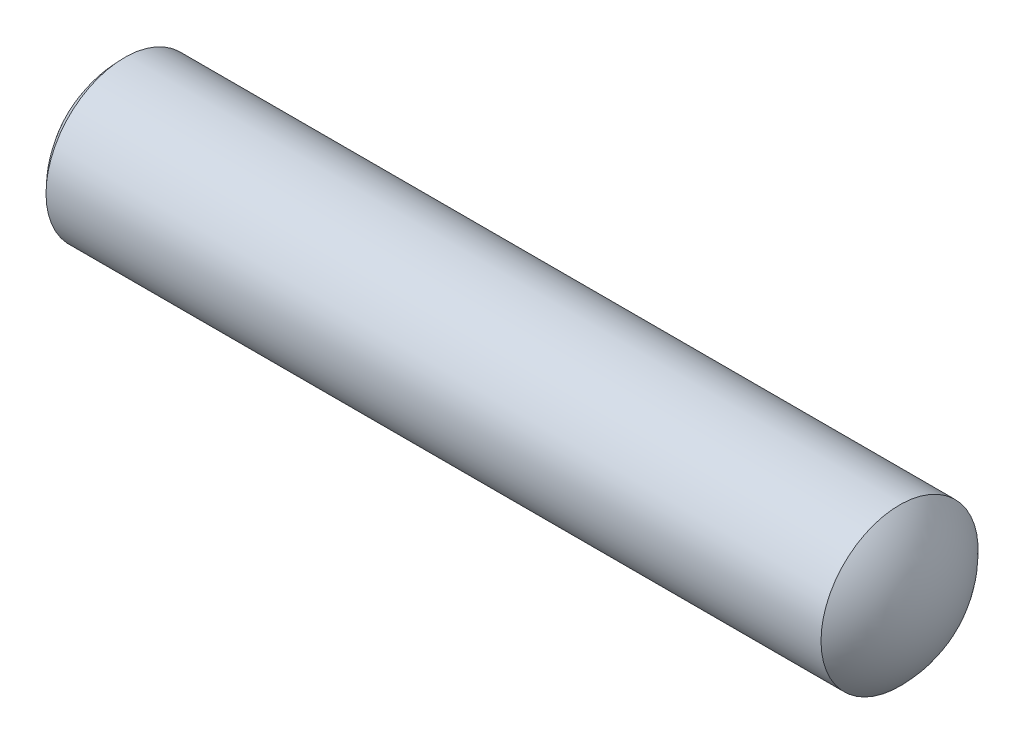
ISO-10303-21;
HEADER;
FILE_DESCRIPTION(('STEP AP214'),'2;1');
FILE_NAME('part.step','',(''),(''),'','','');
FILE_SCHEMA(('AUTOMOTIVE_DESIGN { 1 0 10303 214 1 1 1 1 }'));
ENDSEC;
DATA;
#1=APPLICATION_CONTEXT('core data for automotive mechanical design processes');
#2=APPLICATION_PROTOCOL_DEFINITION('international standard','automotive_design',2000,#1);
#3=PRODUCT_CONTEXT('',#1,'mechanical');
#4=PRODUCT('Part','Part','',(#3));
#5=PRODUCT_RELATED_PRODUCT_CATEGORY('part','',(#4));
#6=PRODUCT_DEFINITION_FORMATION('','',#4);
#7=PRODUCT_DEFINITION_CONTEXT('part definition',#1,'design');
#8=PRODUCT_DEFINITION('design','',#6,#7);
#9=PRODUCT_DEFINITION_SHAPE('','',#8);
#10=(LENGTH_UNIT() NAMED_UNIT(*) SI_UNIT(.MILLI.,.METRE.));
#11=(NAMED_UNIT(*) PLANE_ANGLE_UNIT() SI_UNIT($,.RADIAN.));
#12=(NAMED_UNIT(*) SI_UNIT($,.STERADIAN.) SOLID_ANGLE_UNIT());
#13=UNCERTAINTY_MEASURE_WITH_UNIT(LENGTH_MEASURE(1.E-05),#10,'distance_accuracy_value','');
#14=(GEOMETRIC_REPRESENTATION_CONTEXT(3) GLOBAL_UNCERTAINTY_ASSIGNED_CONTEXT((#13)) GLOBAL_UNIT_ASSIGNED_CONTEXT((#10,
#11,#12)) REPRESENTATION_CONTEXT('',''));
#15=CARTESIAN_POINT('',(0.,0.,0.));
#16=DIRECTION('',(0.,0.,1.));
#17=DIRECTION('',(1.,0.,0.));
#18=AXIS2_PLACEMENT_3D('',#15,#16,#17);
#19=CARTESIAN_POINT('',(15.1875,8.85353246460271,19.3865319009932));
#20=DIRECTION('',(0.,-0.909631995354518,0.415415013001887));
#21=DIRECTION('',(1.,0.,0.));
#22=AXIS2_PLACEMENT_3D('',#19,#20,#21);
#23=SPHERICAL_SURFACE('',#22,1.8375);
#24=CARTESIAN_POINT('',(15.1875,8.85353246460271,19.3865319009932));
#25=DIRECTION('',(-1.,0.,0.));
#26=DIRECTION('',(0.,-0.415415013001886,-0.909631995354519));
#27=AXIS2_PLACEMENT_3D('',#24,#25,#26);
#28=SPHERICAL_SURFACE('',#27,1.8375);
#29=CARTESIAN_POINT('',(16.4734821149612,8.85353246460271,19.3865319009932));
#30=DIRECTION('',(-1.,0.,0.));
#31=DIRECTION('',(0.,-0.415415013001886,-0.909631995354519));
#32=AXIS2_PLACEMENT_3D('',#29,#30,#31);
#33=CIRCLE('',#32,1.3125);
#34=CARTESIAN_POINT('',(16.4734821149612,8.30830026003774,18.1926399070904));
#35=VERTEX_POINT('',#34);
#36=EDGE_CURVE('E11',#35,#35,#33,.T.);
#37=ORIENTED_EDGE('',*,*,#36,.F.);
#38=EDGE_LOOP('',(#37));
#39=FACE_BOUND('',#38,.T.);
#40=ADVANCED_FACE('F17',(#39),#28,.T.);
#41=CARTESIAN_POINT('',(10.,8.8535324646027,19.3865319009932));
#42=DIRECTION('',(-1.,0.,0.));
#43=DIRECTION('',(0.,-0.415415013001886,-0.909631995354519));
#44=AXIS2_PLACEMENT_3D('',#41,#42,#43);
#45=CYLINDRICAL_SURFACE('',#44,1.3125);
#46=CARTESIAN_POINT('',(3.52651788503884,8.8535324646027,19.3865319009932));
#47=DIRECTION('',(-1.,0.,0.));
#48=DIRECTION('',(0.,-0.415415013001886,-0.909631995354519));
#49=AXIS2_PLACEMENT_3D('',#46,#47,#48);
#50=CIRCLE('',#49,1.3125);
#51=CARTESIAN_POINT('',(3.52651788503884,8.30830026003773,18.1926399070904));
#52=VERTEX_POINT('',#51);
#53=EDGE_CURVE('E25',#52,#52,#50,.T.);
#54=ORIENTED_EDGE('',*,*,#53,.F.);
#55=EDGE_LOOP('',(#54));
#56=FACE_BOUND('',#55,.T.);
#57=ORIENTED_EDGE('',*,*,#36,.T.);
#58=EDGE_LOOP('',(#57));
#59=FACE_BOUND('',#58,.T.);
#60=ADVANCED_FACE('F47',(#56,#59),#45,.T.);
#61=CARTESIAN_POINT('',(4.8125,8.8535324646027,19.3865319009932));
#62=DIRECTION('',(0.,-0.909631995354518,0.415415013001887));
#63=DIRECTION('',(-1.,0.,0.));
#64=AXIS2_PLACEMENT_3D('',#61,#62,#63);
#65=SPHERICAL_SURFACE('',#64,1.8375);
#66=CARTESIAN_POINT('',(4.8125,8.8535324646027,19.3865319009932));
#67=DIRECTION('',(-1.,0.,0.));
#68=DIRECTION('',(0.,-0.415415013001886,-0.909631995354519));
#69=AXIS2_PLACEMENT_3D('',#66,#67,#68);
#70=SPHERICAL_SURFACE('',#69,1.8375);
#71=ORIENTED_EDGE('',*,*,#53,.T.);
#72=EDGE_LOOP('',(#71));
#73=FACE_BOUND('',#72,.T.);
#74=ADVANCED_FACE('F39',(#73),#70,.T.);
#75=CLOSED_SHELL('',(#40,#60,#74));
#76=MANIFOLD_SOLID_BREP('B1',#75);
#77=ADVANCED_BREP_SHAPE_REPRESENTATION('',(#18,#76),#14);
#78=SHAPE_DEFINITION_REPRESENTATION(#9,#77);
ENDSEC;
END-ISO-10303-21;
